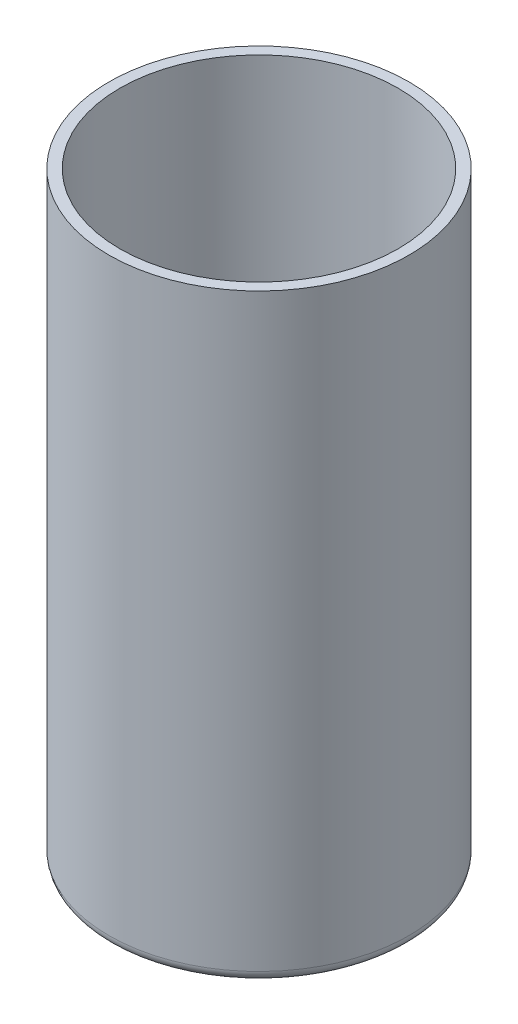
ISO-10303-21;
HEADER;
FILE_DESCRIPTION(('STEP AP214'),'2;1');
FILE_NAME('part.step','',(''),(''),'','','');
FILE_SCHEMA(('AUTOMOTIVE_DESIGN { 1 0 10303 214 1 1 1 1 }'));
ENDSEC;
DATA;
#1=APPLICATION_CONTEXT('core data for automotive mechanical design processes');
#2=APPLICATION_PROTOCOL_DEFINITION('international standard','automotive_design',2000,#1);
#3=PRODUCT_CONTEXT('',#1,'mechanical');
#4=PRODUCT('Part','Part','',(#3));
#5=PRODUCT_RELATED_PRODUCT_CATEGORY('part','',(#4));
#6=PRODUCT_DEFINITION_FORMATION('','',#4);
#7=PRODUCT_DEFINITION_CONTEXT('part definition',#1,'design');
#8=PRODUCT_DEFINITION('design','',#6,#7);
#9=PRODUCT_DEFINITION_SHAPE('','',#8);
#10=(LENGTH_UNIT() NAMED_UNIT(*) SI_UNIT(.MILLI.,.METRE.));
#11=(NAMED_UNIT(*) PLANE_ANGLE_UNIT() SI_UNIT($,.RADIAN.));
#12=(NAMED_UNIT(*) SI_UNIT($,.STERADIAN.) SOLID_ANGLE_UNIT());
#13=UNCERTAINTY_MEASURE_WITH_UNIT(LENGTH_MEASURE(1.E-05),#10,'distance_accuracy_value','');
#14=(GEOMETRIC_REPRESENTATION_CONTEXT(3) GLOBAL_UNCERTAINTY_ASSIGNED_CONTEXT((#13)) GLOBAL_UNIT_ASSIGNED_CONTEXT((#10,
#11,#12)) REPRESENTATION_CONTEXT('',''));
#15=CARTESIAN_POINT('',(0.,0.,0.));
#16=DIRECTION('',(0.,0.,1.));
#17=DIRECTION('',(1.,0.,0.));
#18=AXIS2_PLACEMENT_3D('',#15,#16,#17);
#19=CARTESIAN_POINT('',(0.,11.,0.));
#20=DIRECTION('',(0.,-1.,0.));
#21=DIRECTION('',(0.,0.,-1.));
#22=AXIS2_PLACEMENT_3D('',#19,#20,#21);
#23=CYLINDRICAL_SURFACE('',#22,0.75);
#24=CARTESIAN_POINT('',(0.,0.,0.));
#25=DIRECTION('',(0.,1.,0.));
#26=DIRECTION('',(0.,0.,1.));
#27=AXIS2_PLACEMENT_3D('',#24,#25,#26);
#28=CIRCLE('',#27,0.75);
#29=CARTESIAN_POINT('',(0.,0.,0.75));
#30=VERTEX_POINT('',#29);
#31=EDGE_CURVE('E31',#30,#30,#28,.T.);
#32=ORIENTED_EDGE('',*,*,#31,.F.);
#33=EDGE_LOOP('',(#32));
#34=FACE_BOUND('',#33,.T.);
#35=CARTESIAN_POINT('',(0.,0.200000000000006,0.));
#36=DIRECTION('',(0.,1.,0.));
#37=DIRECTION('',(0.,0.,1.));
#38=AXIS2_PLACEMENT_3D('',#35,#36,#37);
#39=CIRCLE('',#38,0.75);
#40=CARTESIAN_POINT('',(0.,0.200000000000006,0.75));
#41=VERTEX_POINT('',#40);
#42=EDGE_CURVE('E34',#41,#41,#39,.T.);
#43=ORIENTED_EDGE('',*,*,#42,.T.);
#44=EDGE_LOOP('',(#43));
#45=FACE_BOUND('',#44,.T.);
#46=ADVANCED_FACE('F16',(#34,#45),#23,.F.);
#47=CARTESIAN_POINT('',(0.,11.,0.));
#48=DIRECTION('',(0.,1.,0.));
#49=DIRECTION('',(0.,0.,1.));
#50=AXIS2_PLACEMENT_3D('',#47,#48,#49);
#51=PLANE('',#50);
#52=CARTESIAN_POINT('',(0.,11.,0.));
#53=DIRECTION('',(0.,1.,0.));
#54=DIRECTION('',(0.,0.,1.));
#55=AXIS2_PLACEMENT_3D('',#52,#53,#54);
#56=CIRCLE('',#55,2.55);
#57=CARTESIAN_POINT('',(0.,11.,2.55));
#58=VERTEX_POINT('',#57);
#59=EDGE_CURVE('E42',#58,#58,#56,.T.);
#60=ORIENTED_EDGE('',*,*,#59,.F.);
#61=EDGE_LOOP('',(#60));
#62=FACE_BOUND('',#61,.T.);
#63=CARTESIAN_POINT('',(0.,11.,0.));
#64=DIRECTION('',(0.,1.,0.));
#65=DIRECTION('',(0.,0.,1.));
#66=AXIS2_PLACEMENT_3D('',#63,#64,#65);
#67=CIRCLE('',#66,2.75);
#68=CARTESIAN_POINT('',(0.,11.,2.75));
#69=VERTEX_POINT('',#68);
#70=EDGE_CURVE('E27',#69,#69,#67,.T.);
#71=ORIENTED_EDGE('',*,*,#70,.T.);
#72=EDGE_LOOP('',(#71));
#73=FACE_BOUND('',#72,.T.);
#74=ADVANCED_FACE('F48',(#62,#73),#51,.T.);
#75=CARTESIAN_POINT('',(0.,0.,0.));
#76=DIRECTION('',(0.,1.,0.));
#77=DIRECTION('',(0.,0.,1.));
#78=AXIS2_PLACEMENT_3D('',#75,#76,#77);
#79=PLANE('',#78);
#80=CARTESIAN_POINT('',(0.,0.,0.));
#81=DIRECTION('',(0.,1.,0.));
#82=DIRECTION('',(0.,0.,1.));
#83=AXIS2_PLACEMENT_3D('',#80,#81,#82);
#84=CIRCLE('',#83,2.55);
#85=CARTESIAN_POINT('',(0.,0.,2.55));
#86=VERTEX_POINT('',#85);
#87=EDGE_CURVE('E11',#86,#86,#84,.F.);
#88=ORIENTED_EDGE('',*,*,#87,.T.);
#89=EDGE_LOOP('',(#88));
#90=FACE_BOUND('',#89,.T.);
#91=ORIENTED_EDGE('',*,*,#31,.T.);
#92=EDGE_LOOP('',(#91));
#93=FACE_BOUND('',#92,.T.);
#94=ADVANCED_FACE('F51',(#90,#93),#79,.F.);
#95=CARTESIAN_POINT('',(0.,11.,0.));
#96=DIRECTION('',(0.,-1.,0.));
#97=DIRECTION('',(0.,0.,-1.));
#98=AXIS2_PLACEMENT_3D('',#95,#96,#97);
#99=CYLINDRICAL_SURFACE('',#98,2.75);
#100=CARTESIAN_POINT('',(0.,0.200000000000006,0.));
#101=DIRECTION('',(0.,1.,0.));
#102=DIRECTION('',(0.,0.,1.));
#103=AXIS2_PLACEMENT_3D('',#100,#101,#102);
#104=CIRCLE('',#103,2.75);
#105=CARTESIAN_POINT('',(0.,0.200000000000006,2.75));
#106=VERTEX_POINT('',#105);
#107=EDGE_CURVE('E23',#106,#106,#104,.T.);
#108=ORIENTED_EDGE('',*,*,#107,.T.);
#109=EDGE_LOOP('',(#108));
#110=FACE_BOUND('',#109,.T.);
#111=ORIENTED_EDGE('',*,*,#70,.F.);
#112=EDGE_LOOP('',(#111));
#113=FACE_BOUND('',#112,.T.);
#114=ADVANCED_FACE('F55',(#110,#113),#99,.T.);
#115=CARTESIAN_POINT('',(0.,-7.21248916810277,0.));
#116=DIRECTION('',(0.,1.,0.));
#117=DIRECTION('',(0.,0.,1.));
#118=AXIS2_PLACEMENT_3D('',#115,#116,#117);
#119=CYLINDRICAL_SURFACE('',#118,2.55);
#120=CARTESIAN_POINT('',(0.,0.200000000000006,0.));
#121=DIRECTION('',(0.,1.,0.));
#122=DIRECTION('',(0.,0.,1.));
#123=AXIS2_PLACEMENT_3D('',#120,#121,#122);
#124=CIRCLE('',#123,2.55);
#125=CARTESIAN_POINT('',(0.,0.200000000000006,2.55));
#126=VERTEX_POINT('',#125);
#127=EDGE_CURVE('E36',#126,#126,#124,.F.);
#128=ORIENTED_EDGE('',*,*,#127,.T.);
#129=EDGE_LOOP('',(#128));
#130=FACE_BOUND('',#129,.T.);
#131=ORIENTED_EDGE('',*,*,#59,.T.);
#132=EDGE_LOOP('',(#131));
#133=FACE_BOUND('',#132,.T.);
#134=ADVANCED_FACE('F46',(#130,#133),#119,.F.);
#135=CARTESIAN_POINT('',(0.,0.200000000000006,0.));
#136=DIRECTION('',(0.,1.,0.));
#137=DIRECTION('',(0.,0.,1.));
#138=AXIS2_PLACEMENT_3D('',#135,#136,#137);
#139=PLANE('',#138);
#140=ORIENTED_EDGE('',*,*,#42,.F.);
#141=EDGE_LOOP('',(#140));
#142=FACE_BOUND('',#141,.T.);
#143=ORIENTED_EDGE('',*,*,#127,.F.);
#144=EDGE_LOOP('',(#143));
#145=FACE_BOUND('',#144,.T.);
#146=ADVANCED_FACE('F62',(#142,#145),#139,.T.);
#147=CARTESIAN_POINT('',(0.,0.200000000000006,0.));
#148=DIRECTION('',(0.,1.,0.));
#149=DIRECTION('',(0.,0.,1.));
#150=AXIS2_PLACEMENT_3D('',#147,#148,#149);
#151=TOROIDAL_SURFACE('',#150,2.55,0.2);
#152=ORIENTED_EDGE('',*,*,#87,.F.);
#153=EDGE_LOOP('',(#152));
#154=FACE_BOUND('',#153,.T.);
#155=ORIENTED_EDGE('',*,*,#107,.F.);
#156=EDGE_LOOP('',(#155));
#157=FACE_BOUND('',#156,.T.);
#158=ADVANCED_FACE('F18',(#154,#157),#151,.T.);
#159=CLOSED_SHELL('',(#46,#74,#94,#114,#134,#146,#158));
#160=MANIFOLD_SOLID_BREP('B1',#159);
#161=ADVANCED_BREP_SHAPE_REPRESENTATION('',(#18,#160),#14);
#162=SHAPE_DEFINITION_REPRESENTATION(#9,#161);
ENDSEC;
END-ISO-10303-21;
